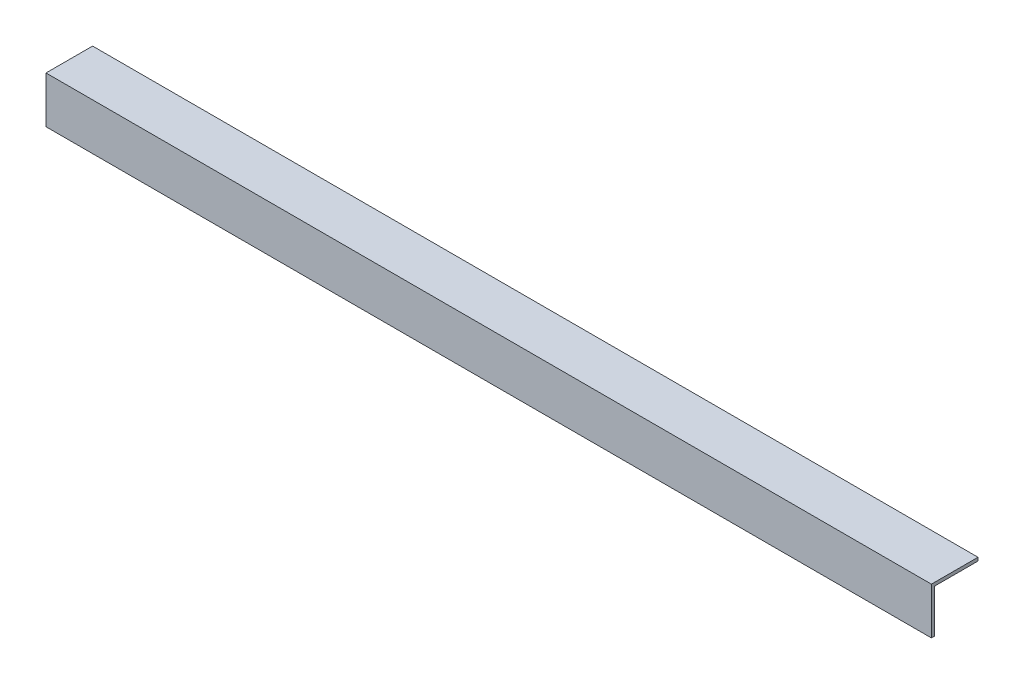
ISO-10303-21;
HEADER;
FILE_DESCRIPTION(('STEP AP214'),'2;1');
FILE_NAME('part.step','',(''),(''),'','','');
FILE_SCHEMA(('AUTOMOTIVE_DESIGN { 1 0 10303 214 1 1 1 1 }'));
ENDSEC;
DATA;
#1=APPLICATION_CONTEXT('core data for automotive mechanical design processes');
#2=APPLICATION_PROTOCOL_DEFINITION('international standard','automotive_design',2000,#1);
#3=PRODUCT_CONTEXT('',#1,'mechanical');
#4=PRODUCT('Part','Part','',(#3));
#5=PRODUCT_RELATED_PRODUCT_CATEGORY('part','',(#4));
#6=PRODUCT_DEFINITION_FORMATION('','',#4);
#7=PRODUCT_DEFINITION_CONTEXT('part definition',#1,'design');
#8=PRODUCT_DEFINITION('design','',#6,#7);
#9=PRODUCT_DEFINITION_SHAPE('','',#8);
#10=(LENGTH_UNIT() NAMED_UNIT(*) SI_UNIT(.MILLI.,.METRE.));
#11=(NAMED_UNIT(*) PLANE_ANGLE_UNIT() SI_UNIT($,.RADIAN.));
#12=(NAMED_UNIT(*) SI_UNIT($,.STERADIAN.) SOLID_ANGLE_UNIT());
#13=UNCERTAINTY_MEASURE_WITH_UNIT(LENGTH_MEASURE(1.E-05),#10,'distance_accuracy_value','');
#14=(GEOMETRIC_REPRESENTATION_CONTEXT(3) GLOBAL_UNCERTAINTY_ASSIGNED_CONTEXT((#13)) GLOBAL_UNIT_ASSIGNED_CONTEXT((#10,
#11,#12)) REPRESENTATION_CONTEXT('',''));
#15=CARTESIAN_POINT('',(0.,0.,0.));
#16=DIRECTION('',(0.,0.,1.));
#17=DIRECTION('',(1.,0.,0.));
#18=AXIS2_PLACEMENT_3D('',#15,#16,#17);
#19=CARTESIAN_POINT('',(-422.275,-44.45,-3.175));
#20=DIRECTION('',(0.,0.,-1.));
#21=DIRECTION('',(-1.,0.,0.));
#22=AXIS2_PLACEMENT_3D('',#19,#20,#21);
#23=PLANE('',#22);
#24=DIRECTION('',(1.,0.,0.));
#25=VECTOR('',#24,1.);
#26=CARTESIAN_POINT('',(-422.275,-44.45,-3.175));
#27=LINE('',#26,#25);
#28=CARTESIAN_POINT('',(-422.275,-44.45,-3.175));
#29=VERTEX_POINT('',#28);
#30=CARTESIAN_POINT('',(422.275,-44.45,-3.175));
#31=VERTEX_POINT('',#30);
#32=EDGE_CURVE('E72',#29,#31,#27,.T.);
#33=ORIENTED_EDGE('',*,*,#32,.F.);
#34=DIRECTION('',(0.,1.,0.));
#35=VECTOR('',#34,1.);
#36=CARTESIAN_POINT('',(-422.275,0.,-3.175));
#37=LINE('',#36,#35);
#38=CARTESIAN_POINT('',(-422.275,-3.175,-3.175));
#39=VERTEX_POINT('',#38);
#40=EDGE_CURVE('E104',#29,#39,#37,.T.);
#41=ORIENTED_EDGE('',*,*,#40,.T.);
#42=DIRECTION('',(1.,0.,0.));
#43=VECTOR('',#42,1.);
#44=CARTESIAN_POINT('',(-422.275,-3.175,-3.175));
#45=LINE('',#44,#43);
#46=CARTESIAN_POINT('',(422.275,-3.175,-3.175));
#47=VERTEX_POINT('',#46);
#48=EDGE_CURVE('E20',#47,#39,#45,.F.);
#49=ORIENTED_EDGE('',*,*,#48,.F.);
#50=DIRECTION('',(0.,1.,0.));
#51=VECTOR('',#50,1.);
#52=CARTESIAN_POINT('',(422.275,0.,-3.175));
#53=LINE('',#52,#51);
#54=EDGE_CURVE('E83',#31,#47,#53,.T.);
#55=ORIENTED_EDGE('',*,*,#54,.F.);
#56=EDGE_LOOP('',(#33,#41,#49,#55));
#57=FACE_BOUND('',#56,.T.);
#58=ADVANCED_FACE('F17',(#57),#23,.T.);
#59=CARTESIAN_POINT('',(-422.275,-3.175,-3.175));
#60=DIRECTION('',(0.,-1.,0.));
#61=DIRECTION('',(0.,0.,-1.));
#62=AXIS2_PLACEMENT_3D('',#59,#60,#61);
#63=PLANE('',#62);
#64=ORIENTED_EDGE('',*,*,#48,.T.);
#65=DIRECTION('',(0.,0.,-1.));
#66=VECTOR('',#65,1.);
#67=CARTESIAN_POINT('',(-422.275,-3.175,0.));
#68=LINE('',#67,#66);
#69=CARTESIAN_POINT('',(-422.275,-3.175,-44.45));
#70=VERTEX_POINT('',#69);
#71=EDGE_CURVE('E101',#39,#70,#68,.T.);
#72=ORIENTED_EDGE('',*,*,#71,.T.);
#73=DIRECTION('',(-1.,0.,0.));
#74=VECTOR('',#73,1.);
#75=CARTESIAN_POINT('',(-422.275,-3.175,-44.45));
#76=LINE('',#75,#74);
#77=CARTESIAN_POINT('',(422.275,-3.175,-44.45));
#78=VERTEX_POINT('',#77);
#79=EDGE_CURVE('E80',#78,#70,#76,.T.);
#80=ORIENTED_EDGE('',*,*,#79,.F.);
#81=DIRECTION('',(0.,0.,-1.));
#82=VECTOR('',#81,1.);
#83=CARTESIAN_POINT('',(422.275,-3.175,0.));
#84=LINE('',#83,#82);
#85=EDGE_CURVE('E86',#47,#78,#84,.T.);
#86=ORIENTED_EDGE('',*,*,#85,.F.);
#87=EDGE_LOOP('',(#64,#72,#80,#86));
#88=FACE_BOUND('',#87,.T.);
#89=ADVANCED_FACE('F100',(#88),#63,.T.);
#90=CARTESIAN_POINT('',(-422.275,-3.175,-44.45));
#91=DIRECTION('',(0.,0.,-1.));
#92=DIRECTION('',(-1.,0.,0.));
#93=AXIS2_PLACEMENT_3D('',#90,#91,#92);
#94=PLANE('',#93);
#95=ORIENTED_EDGE('',*,*,#79,.T.);
#96=DIRECTION('',(0.,1.,0.));
#97=VECTOR('',#96,1.);
#98=CARTESIAN_POINT('',(-422.275,0.,-44.45));
#99=LINE('',#98,#97);
#100=CARTESIAN_POINT('',(-422.275,0.,-44.45));
#101=VERTEX_POINT('',#100);
#102=EDGE_CURVE('E105',#70,#101,#99,.T.);
#103=ORIENTED_EDGE('',*,*,#102,.T.);
#104=DIRECTION('',(1.,0.,0.));
#105=VECTOR('',#104,1.);
#106=CARTESIAN_POINT('',(-422.275,0.,-44.45));
#107=LINE('',#106,#105);
#108=CARTESIAN_POINT('',(422.275,0.,-44.45));
#109=VERTEX_POINT('',#108);
#110=EDGE_CURVE('E112',#109,#101,#107,.F.);
#111=ORIENTED_EDGE('',*,*,#110,.F.);
#112=DIRECTION('',(0.,1.,0.));
#113=VECTOR('',#112,1.);
#114=CARTESIAN_POINT('',(422.275,0.,-44.45));
#115=LINE('',#114,#113);
#116=EDGE_CURVE('E117',#78,#109,#115,.T.);
#117=ORIENTED_EDGE('',*,*,#116,.F.);
#118=EDGE_LOOP('',(#95,#103,#111,#117));
#119=FACE_BOUND('',#118,.T.);
#120=ADVANCED_FACE('F119',(#119),#94,.T.);
#121=CARTESIAN_POINT('',(-422.275,-44.45,0.));
#122=DIRECTION('',(0.,-1.,0.));
#123=DIRECTION('',(0.,0.,-1.));
#124=AXIS2_PLACEMENT_3D('',#121,#122,#123);
#125=PLANE('',#124);
#126=DIRECTION('',(1.,0.,0.));
#127=VECTOR('',#126,1.);
#128=CARTESIAN_POINT('',(-422.275,-44.45,0.));
#129=LINE('',#128,#127);
#130=CARTESIAN_POINT('',(-422.275,-44.45,0.));
#131=VERTEX_POINT('',#130);
#132=CARTESIAN_POINT('',(422.275,-44.45,0.));
#133=VERTEX_POINT('',#132);
#134=EDGE_CURVE('E125',#131,#133,#129,.T.);
#135=ORIENTED_EDGE('',*,*,#134,.F.);
#136=DIRECTION('',(0.,0.,-1.));
#137=VECTOR('',#136,1.);
#138=CARTESIAN_POINT('',(-422.275,-44.45,0.));
#139=LINE('',#138,#137);
#140=EDGE_CURVE('E78',#131,#29,#139,.T.);
#141=ORIENTED_EDGE('',*,*,#140,.T.);
#142=ORIENTED_EDGE('',*,*,#32,.T.);
#143=DIRECTION('',(0.,0.,-1.));
#144=VECTOR('',#143,1.);
#145=CARTESIAN_POINT('',(422.275,-44.45,0.));
#146=LINE('',#145,#144);
#147=EDGE_CURVE('E75',#133,#31,#146,.T.);
#148=ORIENTED_EDGE('',*,*,#147,.F.);
#149=EDGE_LOOP('',(#135,#141,#142,#148));
#150=FACE_BOUND('',#149,.T.);
#151=ADVANCED_FACE('F73',(#150),#125,.T.);
#152=CARTESIAN_POINT('',(422.275,0.,0.));
#153=DIRECTION('',(1.,0.,0.));
#154=DIRECTION('',(0.,0.,-1.));
#155=AXIS2_PLACEMENT_3D('',#152,#153,#154);
#156=PLANE('',#155);
#157=DIRECTION('',(0.,0.,1.));
#158=VECTOR('',#157,1.);
#159=CARTESIAN_POINT('',(422.275,0.,-44.45));
#160=LINE('',#159,#158);
#161=CARTESIAN_POINT('',(422.275,0.,0.));
#162=VERTEX_POINT('',#161);
#163=EDGE_CURVE('E114',#162,#109,#160,.F.);
#164=ORIENTED_EDGE('',*,*,#163,.F.);
#165=DIRECTION('',(0.,1.,0.));
#166=VECTOR('',#165,1.);
#167=CARTESIAN_POINT('',(422.275,0.,0.));
#168=LINE('',#167,#166);
#169=EDGE_CURVE('E90',#133,#162,#168,.T.);
#170=ORIENTED_EDGE('',*,*,#169,.F.);
#171=ORIENTED_EDGE('',*,*,#147,.T.);
#172=ORIENTED_EDGE('',*,*,#54,.T.);
#173=ORIENTED_EDGE('',*,*,#85,.T.);
#174=ORIENTED_EDGE('',*,*,#116,.T.);
#175=EDGE_LOOP('',(#164,#170,#171,#172,#173,#174));
#176=FACE_BOUND('',#175,.T.);
#177=ADVANCED_FACE('F88',(#176),#156,.T.);
#178=CARTESIAN_POINT('',(-422.275,0.,-44.45));
#179=DIRECTION('',(0.,1.,0.));
#180=DIRECTION('',(0.,0.,1.));
#181=AXIS2_PLACEMENT_3D('',#178,#179,#180);
#182=PLANE('',#181);
#183=ORIENTED_EDGE('',*,*,#110,.T.);
#184=DIRECTION('',(0.,0.,-1.));
#185=VECTOR('',#184,1.);
#186=CARTESIAN_POINT('',(-422.275,0.,0.));
#187=LINE('',#186,#185);
#188=CARTESIAN_POINT('',(-422.275,0.,0.));
#189=VERTEX_POINT('',#188);
#190=EDGE_CURVE('E35',#101,#189,#187,.F.);
#191=ORIENTED_EDGE('',*,*,#190,.T.);
#192=DIRECTION('',(1.,0.,0.));
#193=VECTOR('',#192,1.);
#194=CARTESIAN_POINT('',(-422.275,0.,0.));
#195=LINE('',#194,#193);
#196=EDGE_CURVE('E26',#162,#189,#195,.F.);
#197=ORIENTED_EDGE('',*,*,#196,.F.);
#198=ORIENTED_EDGE('',*,*,#163,.T.);
#199=EDGE_LOOP('',(#183,#191,#197,#198));
#200=FACE_BOUND('',#199,.T.);
#201=ADVANCED_FACE('F120',(#200),#182,.T.);
#202=CARTESIAN_POINT('',(-422.275,0.,0.));
#203=DIRECTION('',(1.,0.,0.));
#204=DIRECTION('',(0.,0.,-1.));
#205=AXIS2_PLACEMENT_3D('',#202,#203,#204);
#206=PLANE('',#205);
#207=ORIENTED_EDGE('',*,*,#102,.F.);
#208=ORIENTED_EDGE('',*,*,#71,.F.);
#209=ORIENTED_EDGE('',*,*,#40,.F.);
#210=ORIENTED_EDGE('',*,*,#140,.F.);
#211=DIRECTION('',(0.,1.,0.));
#212=VECTOR('',#211,1.);
#213=CARTESIAN_POINT('',(-422.275,0.,0.));
#214=LINE('',#213,#212);
#215=EDGE_CURVE('E11',#189,#131,#214,.F.);
#216=ORIENTED_EDGE('',*,*,#215,.F.);
#217=ORIENTED_EDGE('',*,*,#190,.F.);
#218=EDGE_LOOP('',(#207,#208,#209,#210,#216,#217));
#219=FACE_BOUND('',#218,.T.);
#220=ADVANCED_FACE('F103',(#219),#206,.F.);
#221=CARTESIAN_POINT('',(-422.275,0.,0.));
#222=DIRECTION('',(0.,0.,1.));
#223=DIRECTION('',(1.,0.,0.));
#224=AXIS2_PLACEMENT_3D('',#221,#222,#223);
#225=PLANE('',#224);
#226=ORIENTED_EDGE('',*,*,#196,.T.);
#227=ORIENTED_EDGE('',*,*,#215,.T.);
#228=ORIENTED_EDGE('',*,*,#134,.T.);
#229=ORIENTED_EDGE('',*,*,#169,.T.);
#230=EDGE_LOOP('',(#226,#227,#228,#229));
#231=FACE_BOUND('',#230,.T.);
#232=ADVANCED_FACE('F124',(#231),#225,.T.);
#233=CLOSED_SHELL('',(#58,#89,#120,#151,#177,#201,#220,#232));
#234=MANIFOLD_SOLID_BREP('B1',#233);
#235=ADVANCED_BREP_SHAPE_REPRESENTATION('',(#18,#234),#14);
#236=SHAPE_DEFINITION_REPRESENTATION(#9,#235);
ENDSEC;
END-ISO-10303-21;
